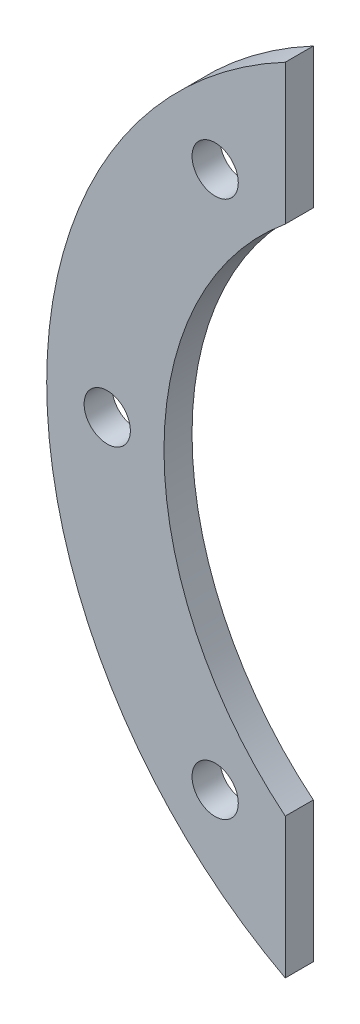
ISO-10303-21;
HEADER;
FILE_DESCRIPTION(('STEP AP214'),'2;1');
FILE_NAME('part.step','',(''),(''),'','','');
FILE_SCHEMA(('AUTOMOTIVE_DESIGN { 1 0 10303 214 1 1 1 1 }'));
ENDSEC;
DATA;
#1=APPLICATION_CONTEXT('core data for automotive mechanical design processes');
#2=APPLICATION_PROTOCOL_DEFINITION('international standard','automotive_design',2000,#1);
#3=PRODUCT_CONTEXT('',#1,'mechanical');
#4=PRODUCT('Part','Part','',(#3));
#5=PRODUCT_RELATED_PRODUCT_CATEGORY('part','',(#4));
#6=PRODUCT_DEFINITION_FORMATION('','',#4);
#7=PRODUCT_DEFINITION_CONTEXT('part definition',#1,'design');
#8=PRODUCT_DEFINITION('design','',#6,#7);
#9=PRODUCT_DEFINITION_SHAPE('','',#8);
#10=(LENGTH_UNIT() NAMED_UNIT(*) SI_UNIT(.MILLI.,.METRE.));
#11=(NAMED_UNIT(*) PLANE_ANGLE_UNIT() SI_UNIT($,.RADIAN.));
#12=(NAMED_UNIT(*) SI_UNIT($,.STERADIAN.) SOLID_ANGLE_UNIT());
#13=UNCERTAINTY_MEASURE_WITH_UNIT(LENGTH_MEASURE(1.E-05),#10,'distance_accuracy_value','');
#14=(GEOMETRIC_REPRESENTATION_CONTEXT(3) GLOBAL_UNCERTAINTY_ASSIGNED_CONTEXT((#13)) GLOBAL_UNIT_ASSIGNED_CONTEXT((#10,
#11,#12)) REPRESENTATION_CONTEXT('',''));
#15=CARTESIAN_POINT('',(0.,0.,0.));
#16=DIRECTION('',(0.,0.,1.));
#17=DIRECTION('',(1.,0.,0.));
#18=AXIS2_PLACEMENT_3D('',#15,#16,#17);
#19=CARTESIAN_POINT('',(25.,50.,2.));
#20=DIRECTION('',(0.,0.,1.));
#21=DIRECTION('',(1.,0.,0.));
#22=AXIS2_PLACEMENT_3D('',#19,#20,#21);
#23=PLANE('',#22);
#24=CARTESIAN_POINT('',(5.,30.8386512080861,2.));
#25=DIRECTION('',(0.,0.,1.));
#26=DIRECTION('',(1.,0.,0.));
#27=AXIS2_PLACEMENT_3D('',#24,#25,#26);
#28=CIRCLE('',#27,1.65);
#29=CARTESIAN_POINT('',(6.65,30.8386512080861,2.));
#30=VERTEX_POINT('',#29);
#31=EDGE_CURVE('E180',#30,#30,#28,.T.);
#32=ORIENTED_EDGE('',*,*,#31,.F.);
#33=EDGE_LOOP('',(#32));
#34=FACE_BOUND('',#33,.T.);
#35=CARTESIAN_POINT('',(-2.69760436437384,50.,2.));
#36=DIRECTION('',(0.,0.,1.));
#37=DIRECTION('',(1.,0.,0.));
#38=AXIS2_PLACEMENT_3D('',#35,#36,#37);
#39=CIRCLE('',#38,1.65);
#40=CARTESIAN_POINT('',(-1.04760436437384,50.,2.));
#41=VERTEX_POINT('',#40);
#42=EDGE_CURVE('E117',#41,#41,#39,.T.);
#43=ORIENTED_EDGE('',*,*,#42,.F.);
#44=EDGE_LOOP('',(#43));
#45=FACE_BOUND('',#44,.T.);
#46=CARTESIAN_POINT('',(5.,69.1613487919139,2.));
#47=DIRECTION('',(0.,0.,1.));
#48=DIRECTION('',(1.,0.,0.));
#49=AXIS2_PLACEMENT_3D('',#46,#47,#48);
#50=CIRCLE('',#49,1.65);
#51=CARTESIAN_POINT('',(6.65,69.1613487919139,2.));
#52=VERTEX_POINT('',#51);
#53=EDGE_CURVE('E171',#52,#52,#50,.T.);
#54=ORIENTED_EDGE('',*,*,#53,.F.);
#55=EDGE_LOOP('',(#54));
#56=FACE_BOUND('',#55,.T.);
#57=CARTESIAN_POINT('',(25.,50.,2.));
#58=DIRECTION('',(0.,0.,1.));
#59=DIRECTION('',(1.,0.,0.));
#60=AXIS2_PLACEMENT_3D('',#57,#58,#59);
#61=CIRCLE('',#60,32.0156211871642);
#62=CARTESIAN_POINT('',(10.,78.2842712474619,2.));
#63=VERTEX_POINT('',#62);
#64=CARTESIAN_POINT('',(10.,21.7157287525381,2.));
#65=VERTEX_POINT('',#64);
#66=EDGE_CURVE('E88',#63,#65,#61,.T.);
#67=ORIENTED_EDGE('',*,*,#66,.T.);
#68=DIRECTION('',(0.,1.,0.));
#69=VECTOR('',#68,1.);
#70=CARTESIAN_POINT('',(10.,0.,2.));
#71=LINE('',#70,#69);
#72=CARTESIAN_POINT('',(10.,31.7157287525381,2.));
#73=VERTEX_POINT('',#72);
#74=EDGE_CURVE('E84',#65,#73,#71,.T.);
#75=ORIENTED_EDGE('',*,*,#74,.T.);
#76=CARTESIAN_POINT('',(25.,50.,2.));
#77=DIRECTION('',(0.,0.,-1.));
#78=DIRECTION('',(1.,0.,0.));
#79=AXIS2_PLACEMENT_3D('',#76,#77,#78);
#80=CIRCLE('',#79,23.649832452911);
#81=CARTESIAN_POINT('',(10.,68.2842712474619,2.));
#82=VERTEX_POINT('',#81);
#83=EDGE_CURVE('E101',#73,#82,#80,.T.);
#84=ORIENTED_EDGE('',*,*,#83,.T.);
#85=DIRECTION('',(0.,1.,0.));
#86=VECTOR('',#85,1.);
#87=CARTESIAN_POINT('',(10.,68.2842712474619,2.));
#88=LINE('',#87,#86);
#89=EDGE_CURVE('E64',#82,#63,#88,.T.);
#90=ORIENTED_EDGE('',*,*,#89,.T.);
#91=EDGE_LOOP('',(#67,#75,#84,#90));
#92=FACE_BOUND('',#91,.T.);
#93=ADVANCED_FACE('F39',(#34,#45,#56,#92),#23,.T.);
#94=CARTESIAN_POINT('',(25.,50.,0.));
#95=DIRECTION('',(0.,0.,1.));
#96=DIRECTION('',(1.,0.,0.));
#97=AXIS2_PLACEMENT_3D('',#94,#95,#96);
#98=PLANE('',#97);
#99=CARTESIAN_POINT('',(5.,30.8386512080861,0.));
#100=DIRECTION('',(0.,0.,1.));
#101=DIRECTION('',(1.,0.,0.));
#102=AXIS2_PLACEMENT_3D('',#99,#100,#101);
#103=CIRCLE('',#102,1.65);
#104=CARTESIAN_POINT('',(6.65,30.8386512080861,0.));
#105=VERTEX_POINT('',#104);
#106=EDGE_CURVE('E97',#105,#105,#103,.T.);
#107=ORIENTED_EDGE('',*,*,#106,.T.);
#108=EDGE_LOOP('',(#107));
#109=FACE_BOUND('',#108,.T.);
#110=CARTESIAN_POINT('',(5.,69.1613487919139,0.));
#111=DIRECTION('',(0.,0.,1.));
#112=DIRECTION('',(1.,0.,0.));
#113=AXIS2_PLACEMENT_3D('',#110,#111,#112);
#114=CIRCLE('',#113,1.65);
#115=CARTESIAN_POINT('',(6.65,69.1613487919139,0.));
#116=VERTEX_POINT('',#115);
#117=EDGE_CURVE('E175',#116,#116,#114,.T.);
#118=ORIENTED_EDGE('',*,*,#117,.T.);
#119=EDGE_LOOP('',(#118));
#120=FACE_BOUND('',#119,.T.);
#121=CARTESIAN_POINT('',(-2.69760436437384,50.,0.));
#122=DIRECTION('',(0.,0.,1.));
#123=DIRECTION('',(1.,0.,0.));
#124=AXIS2_PLACEMENT_3D('',#121,#122,#123);
#125=CIRCLE('',#124,1.65);
#126=CARTESIAN_POINT('',(-1.04760436437384,50.,0.));
#127=VERTEX_POINT('',#126);
#128=EDGE_CURVE('E108',#127,#127,#125,.T.);
#129=ORIENTED_EDGE('',*,*,#128,.T.);
#130=EDGE_LOOP('',(#129));
#131=FACE_BOUND('',#130,.T.);
#132=DIRECTION('',(0.,1.,0.));
#133=VECTOR('',#132,1.);
#134=CARTESIAN_POINT('',(10.,0.,0.));
#135=LINE('',#134,#133);
#136=CARTESIAN_POINT('',(10.,21.7157287525381,0.));
#137=VERTEX_POINT('',#136);
#138=CARTESIAN_POINT('',(10.,31.7157287525381,0.));
#139=VERTEX_POINT('',#138);
#140=EDGE_CURVE('E113',#137,#139,#135,.T.);
#141=ORIENTED_EDGE('',*,*,#140,.F.);
#142=CARTESIAN_POINT('',(25.,50.,0.));
#143=DIRECTION('',(0.,0.,1.));
#144=DIRECTION('',(1.,0.,0.));
#145=AXIS2_PLACEMENT_3D('',#142,#143,#144);
#146=CIRCLE('',#145,32.0156211871642);
#147=CARTESIAN_POINT('',(10.,78.2842712474619,0.));
#148=VERTEX_POINT('',#147);
#149=EDGE_CURVE('E55',#148,#137,#146,.T.);
#150=ORIENTED_EDGE('',*,*,#149,.F.);
#151=DIRECTION('',(0.,1.,0.));
#152=VECTOR('',#151,1.);
#153=CARTESIAN_POINT('',(10.,68.2842712474619,0.));
#154=LINE('',#153,#152);
#155=CARTESIAN_POINT('',(10.,68.2842712474619,0.));
#156=VERTEX_POINT('',#155);
#157=EDGE_CURVE('E81',#156,#148,#154,.T.);
#158=ORIENTED_EDGE('',*,*,#157,.F.);
#159=CARTESIAN_POINT('',(25.,50.,0.));
#160=DIRECTION('',(0.,0.,-1.));
#161=DIRECTION('',(1.,0.,0.));
#162=AXIS2_PLACEMENT_3D('',#159,#160,#161);
#163=CIRCLE('',#162,23.649832452911);
#164=EDGE_CURVE('E116',#139,#156,#163,.T.);
#165=ORIENTED_EDGE('',*,*,#164,.F.);
#166=EDGE_LOOP('',(#141,#150,#158,#165));
#167=FACE_BOUND('',#166,.T.);
#168=ADVANCED_FACE('F129',(#109,#120,#131,#167),#98,.F.);
#169=CARTESIAN_POINT('',(10.,0.,2.));
#170=DIRECTION('',(-1.,0.,0.));
#171=DIRECTION('',(0.,0.,1.));
#172=AXIS2_PLACEMENT_3D('',#169,#170,#171);
#173=PLANE('',#172);
#174=DIRECTION('',(0.,0.,1.));
#175=VECTOR('',#174,1.);
#176=CARTESIAN_POINT('',(10.,21.7157287525381,-8.));
#177=LINE('',#176,#175);
#178=EDGE_CURVE('E92',#137,#65,#177,.T.);
#179=ORIENTED_EDGE('',*,*,#178,.F.);
#180=ORIENTED_EDGE('',*,*,#140,.T.);
#181=DIRECTION('',(0.,0.,-1.));
#182=VECTOR('',#181,1.);
#183=CARTESIAN_POINT('',(10.,31.7157287525381,2.));
#184=LINE('',#183,#182);
#185=EDGE_CURVE('E12',#73,#139,#184,.T.);
#186=ORIENTED_EDGE('',*,*,#185,.F.);
#187=ORIENTED_EDGE('',*,*,#74,.F.);
#188=EDGE_LOOP('',(#179,#180,#186,#187));
#189=FACE_BOUND('',#188,.T.);
#190=ADVANCED_FACE('F41',(#189),#173,.F.);
#191=CARTESIAN_POINT('',(25.,50.,2.));
#192=DIRECTION('',(0.,0.,-1.));
#193=DIRECTION('',(-1.,0.,0.));
#194=AXIS2_PLACEMENT_3D('',#191,#192,#193);
#195=CYLINDRICAL_SURFACE('',#194,23.649832452911);
#196=ORIENTED_EDGE('',*,*,#164,.T.);
#197=DIRECTION('',(0.,0.,-1.));
#198=VECTOR('',#197,1.);
#199=CARTESIAN_POINT('',(10.,68.2842712474619,2.));
#200=LINE('',#199,#198);
#201=EDGE_CURVE('E48',#82,#156,#200,.T.);
#202=ORIENTED_EDGE('',*,*,#201,.F.);
#203=ORIENTED_EDGE('',*,*,#83,.F.);
#204=ORIENTED_EDGE('',*,*,#185,.T.);
#205=EDGE_LOOP('',(#196,#202,#203,#204));
#206=FACE_BOUND('',#205,.T.);
#207=ADVANCED_FACE('F130',(#206),#195,.F.);
#208=CARTESIAN_POINT('',(10.,68.2842712474619,2.));
#209=DIRECTION('',(-1.,0.,0.));
#210=DIRECTION('',(0.,-1.,0.));
#211=AXIS2_PLACEMENT_3D('',#208,#209,#210);
#212=PLANE('',#211);
#213=ORIENTED_EDGE('',*,*,#157,.T.);
#214=DIRECTION('',(0.,0.,-1.));
#215=VECTOR('',#214,1.);
#216=CARTESIAN_POINT('',(10.,78.2842712474619,2.));
#217=LINE('',#216,#215);
#218=EDGE_CURVE('E90',#63,#148,#217,.T.);
#219=ORIENTED_EDGE('',*,*,#218,.F.);
#220=ORIENTED_EDGE('',*,*,#89,.F.);
#221=ORIENTED_EDGE('',*,*,#201,.T.);
#222=EDGE_LOOP('',(#213,#219,#220,#221));
#223=FACE_BOUND('',#222,.T.);
#224=ADVANCED_FACE('F125',(#223),#212,.F.);
#225=CARTESIAN_POINT('',(25.,50.,2.));
#226=DIRECTION('',(0.,0.,-1.));
#227=DIRECTION('',(-1.,0.,0.));
#228=AXIS2_PLACEMENT_3D('',#225,#226,#227);
#229=CYLINDRICAL_SURFACE('',#228,32.0156211871642);
#230=ORIENTED_EDGE('',*,*,#149,.T.);
#231=ORIENTED_EDGE('',*,*,#178,.T.);
#232=ORIENTED_EDGE('',*,*,#66,.F.);
#233=ORIENTED_EDGE('',*,*,#218,.T.);
#234=EDGE_LOOP('',(#230,#231,#232,#233));
#235=FACE_BOUND('',#234,.T.);
#236=ADVANCED_FACE('F93',(#235),#229,.T.);
#237=CARTESIAN_POINT('',(-2.69760436437384,50.,2.));
#238=DIRECTION('',(0.,0.,-1.));
#239=DIRECTION('',(-1.,0.,0.));
#240=AXIS2_PLACEMENT_3D('',#237,#238,#239);
#241=CYLINDRICAL_SURFACE('',#240,1.65);
#242=ORIENTED_EDGE('',*,*,#42,.T.);
#243=EDGE_LOOP('',(#242));
#244=FACE_BOUND('',#243,.T.);
#245=ORIENTED_EDGE('',*,*,#128,.F.);
#246=EDGE_LOOP('',(#245));
#247=FACE_BOUND('',#246,.T.);
#248=ADVANCED_FACE('F149',(#244,#247),#241,.F.);
#249=CARTESIAN_POINT('',(5.,69.1613487919139,2.));
#250=DIRECTION('',(0.,0.,-1.));
#251=DIRECTION('',(-1.,0.,0.));
#252=AXIS2_PLACEMENT_3D('',#249,#250,#251);
#253=CYLINDRICAL_SURFACE('',#252,1.65);
#254=ORIENTED_EDGE('',*,*,#53,.T.);
#255=EDGE_LOOP('',(#254));
#256=FACE_BOUND('',#255,.T.);
#257=ORIENTED_EDGE('',*,*,#117,.F.);
#258=EDGE_LOOP('',(#257));
#259=FACE_BOUND('',#258,.T.);
#260=ADVANCED_FACE('F157',(#256,#259),#253,.F.);
#261=CARTESIAN_POINT('',(5.,30.8386512080861,2.));
#262=DIRECTION('',(0.,0.,-1.));
#263=DIRECTION('',(-1.,0.,0.));
#264=AXIS2_PLACEMENT_3D('',#261,#262,#263);
#265=CYLINDRICAL_SURFACE('',#264,1.65);
#266=ORIENTED_EDGE('',*,*,#31,.T.);
#267=EDGE_LOOP('',(#266));
#268=FACE_BOUND('',#267,.T.);
#269=ORIENTED_EDGE('',*,*,#106,.F.);
#270=EDGE_LOOP('',(#269));
#271=FACE_BOUND('',#270,.T.);
#272=ADVANCED_FACE('F162',(#268,#271),#265,.F.);
#273=CLOSED_SHELL('',(#93,#168,#190,#207,#224,#236,#248,#260,#272));
#274=MANIFOLD_SOLID_BREP('B2',#273);
#275=ADVANCED_BREP_SHAPE_REPRESENTATION('',(#18,#274),#14);
#276=SHAPE_DEFINITION_REPRESENTATION(#9,#275);
ENDSEC;
END-ISO-10303-21;
